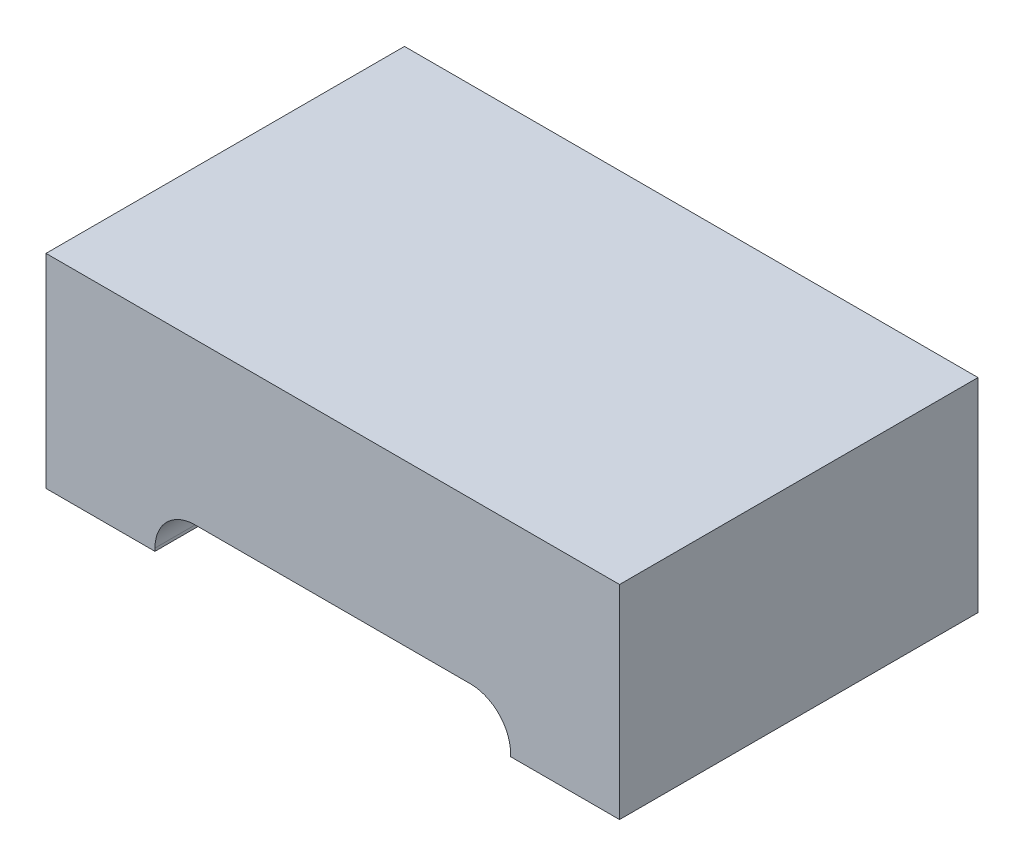
ISO-10303-21;
HEADER;
FILE_DESCRIPTION(('STEP AP214'),'2;1');
FILE_NAME('part.step','',(''),(''),'','','');
FILE_SCHEMA(('AUTOMOTIVE_DESIGN { 1 0 10303 214 1 1 1 1 }'));
ENDSEC;
DATA;
#1=APPLICATION_CONTEXT('core data for automotive mechanical design processes');
#2=APPLICATION_PROTOCOL_DEFINITION('international standard','automotive_design',2000,#1);
#3=PRODUCT_CONTEXT('',#1,'mechanical');
#4=PRODUCT('Part','Part','',(#3));
#5=PRODUCT_RELATED_PRODUCT_CATEGORY('part','',(#4));
#6=PRODUCT_DEFINITION_FORMATION('','',#4);
#7=PRODUCT_DEFINITION_CONTEXT('part definition',#1,'design');
#8=PRODUCT_DEFINITION('design','',#6,#7);
#9=PRODUCT_DEFINITION_SHAPE('','',#8);
#10=(LENGTH_UNIT() NAMED_UNIT(*) SI_UNIT(.MILLI.,.METRE.));
#11=(NAMED_UNIT(*) PLANE_ANGLE_UNIT() SI_UNIT($,.RADIAN.));
#12=(NAMED_UNIT(*) SI_UNIT($,.STERADIAN.) SOLID_ANGLE_UNIT());
#13=UNCERTAINTY_MEASURE_WITH_UNIT(LENGTH_MEASURE(1.E-05),#10,'distance_accuracy_value','');
#14=(GEOMETRIC_REPRESENTATION_CONTEXT(3) GLOBAL_UNCERTAINTY_ASSIGNED_CONTEXT((#13)) GLOBAL_UNIT_ASSIGNED_CONTEXT((#10,
#11,#12)) REPRESENTATION_CONTEXT('',''));
#15=CARTESIAN_POINT('',(0.,0.,0.));
#16=DIRECTION('',(0.,0.,1.));
#17=DIRECTION('',(1.,0.,0.));
#18=AXIS2_PLACEMENT_3D('',#15,#16,#17);
#19=CARTESIAN_POINT('',(0.,0.,0.));
#20=DIRECTION('',(0.,-1.,0.));
#21=DIRECTION('',(0.,0.,-1.));
#22=AXIS2_PLACEMENT_3D('',#19,#20,#21);
#23=PLANE('',#22);
#24=DIRECTION('',(0.,0.,1.));
#25=VECTOR('',#24,1.);
#26=CARTESIAN_POINT('',(-0.62,0.,-0.625));
#27=LINE('',#26,#25);
#28=CARTESIAN_POINT('',(-0.62,0.,-0.625));
#29=VERTEX_POINT('',#28);
#30=CARTESIAN_POINT('',(-0.62,0.,0.625));
#31=VERTEX_POINT('',#30);
#32=EDGE_CURVE('E122',#29,#31,#27,.T.);
#33=ORIENTED_EDGE('',*,*,#32,.T.);
#34=DIRECTION('',(1.,0.,0.));
#35=VECTOR('',#34,1.);
#36=CARTESIAN_POINT('',(-1.,0.,0.625));
#37=LINE('',#36,#35);
#38=CARTESIAN_POINT('',(-1.,0.,0.625));
#39=VERTEX_POINT('',#38);
#40=EDGE_CURVE('E134',#39,#31,#37,.T.);
#41=ORIENTED_EDGE('',*,*,#40,.F.);
#42=DIRECTION('',(0.,0.,1.));
#43=VECTOR('',#42,1.);
#44=CARTESIAN_POINT('',(-1.,0.,0.625));
#45=LINE('',#44,#43);
#46=CARTESIAN_POINT('',(-1.,0.,-0.625));
#47=VERTEX_POINT('',#46);
#48=EDGE_CURVE('E146',#47,#39,#45,.T.);
#49=ORIENTED_EDGE('',*,*,#48,.F.);
#50=DIRECTION('',(-1.,0.,0.));
#51=VECTOR('',#50,1.);
#52=CARTESIAN_POINT('',(-1.,0.,-0.625));
#53=LINE('',#52,#51);
#54=EDGE_CURVE('E135',#29,#47,#53,.T.);
#55=ORIENTED_EDGE('',*,*,#54,.F.);
#56=EDGE_LOOP('',(#33,#41,#49,#55));
#57=FACE_BOUND('',#56,.T.);
#58=ADVANCED_FACE('F33',(#57),#23,.T.);
#59=CARTESIAN_POINT('',(1.,0.71,0.625));
#60=DIRECTION('',(-1.,0.,0.));
#61=DIRECTION('',(0.,0.,1.));
#62=AXIS2_PLACEMENT_3D('',#59,#60,#61);
#63=PLANE('',#62);
#64=DIRECTION('',(0.,0.,-1.));
#65=VECTOR('',#64,1.);
#66=CARTESIAN_POINT('',(1.,0.,0.625));
#67=LINE('',#66,#65);
#68=CARTESIAN_POINT('',(1.,0.,0.625));
#69=VERTEX_POINT('',#68);
#70=CARTESIAN_POINT('',(1.,0.,-0.625));
#71=VERTEX_POINT('',#70);
#72=EDGE_CURVE('E159',#69,#71,#67,.T.);
#73=ORIENTED_EDGE('',*,*,#72,.T.);
#74=DIRECTION('',(0.,-1.,0.));
#75=VECTOR('',#74,1.);
#76=CARTESIAN_POINT('',(1.,0.71,-0.625));
#77=LINE('',#76,#75);
#78=CARTESIAN_POINT('',(1.,0.71,-0.625));
#79=VERTEX_POINT('',#78);
#80=EDGE_CURVE('E11',#79,#71,#77,.T.);
#81=ORIENTED_EDGE('',*,*,#80,.F.);
#82=DIRECTION('',(0.,0.,-1.));
#83=VECTOR('',#82,1.);
#84=CARTESIAN_POINT('',(1.,0.71,0.625));
#85=LINE('',#84,#83);
#86=CARTESIAN_POINT('',(1.,0.71,0.625));
#87=VERTEX_POINT('',#86);
#88=EDGE_CURVE('E143',#87,#79,#85,.T.);
#89=ORIENTED_EDGE('',*,*,#88,.F.);
#90=DIRECTION('',(0.,-1.,0.));
#91=VECTOR('',#90,1.);
#92=CARTESIAN_POINT('',(1.,0.71,0.625));
#93=LINE('',#92,#91);
#94=EDGE_CURVE('E150',#87,#69,#93,.T.);
#95=ORIENTED_EDGE('',*,*,#94,.T.);
#96=EDGE_LOOP('',(#73,#81,#89,#95));
#97=FACE_BOUND('',#96,.T.);
#98=ADVANCED_FACE('F35',(#97),#63,.F.);
#99=CARTESIAN_POINT('',(-1.,0.71,-0.625));
#100=DIRECTION('',(0.,0.,1.));
#101=DIRECTION('',(1.,0.,0.));
#102=AXIS2_PLACEMENT_3D('',#99,#100,#101);
#103=PLANE('',#102);
#104=CARTESIAN_POINT('',(-0.48,0.01,-0.625));
#105=DIRECTION('',(0.,0.,1.));
#106=DIRECTION('',(-1.,0.,0.));
#107=AXIS2_PLACEMENT_3D('',#104,#105,#106);
#108=CIRCLE('',#107,0.14);
#109=CARTESIAN_POINT('',(-0.479999999999999,0.15,-0.625));
#110=VERTEX_POINT('',#109);
#111=CARTESIAN_POINT('',(-0.62,0.009999999999999,-0.625));
#112=VERTEX_POINT('',#111);
#113=EDGE_CURVE('E137',#110,#112,#108,.T.);
#114=ORIENTED_EDGE('',*,*,#113,.T.);
#115=DIRECTION('',(0.,-1.,0.));
#116=VECTOR('',#115,1.);
#117=CARTESIAN_POINT('',(-0.62,0.,-0.625));
#118=LINE('',#117,#116);
#119=EDGE_CURVE('E183',#112,#29,#118,.T.);
#120=ORIENTED_EDGE('',*,*,#119,.T.);
#121=ORIENTED_EDGE('',*,*,#54,.T.);
#122=DIRECTION('',(0.,-1.,0.));
#123=VECTOR('',#122,1.);
#124=CARTESIAN_POINT('',(-1.,0.71,-0.625));
#125=LINE('',#124,#123);
#126=CARTESIAN_POINT('',(-1.,0.71,-0.625));
#127=VERTEX_POINT('',#126);
#128=EDGE_CURVE('E41',#127,#47,#125,.T.);
#129=ORIENTED_EDGE('',*,*,#128,.F.);
#130=DIRECTION('',(-1.,0.,0.));
#131=VECTOR('',#130,1.);
#132=CARTESIAN_POINT('',(-1.,0.71,-0.625));
#133=LINE('',#132,#131);
#134=EDGE_CURVE('E85',#79,#127,#133,.T.);
#135=ORIENTED_EDGE('',*,*,#134,.F.);
#136=ORIENTED_EDGE('',*,*,#80,.T.);
#137=CARTESIAN_POINT('',(0.62,0.,-0.625));
#138=VERTEX_POINT('',#137);
#139=EDGE_CURVE('E157',#71,#138,#53,.T.);
#140=ORIENTED_EDGE('',*,*,#139,.T.);
#141=DIRECTION('',(0.,1.,0.));
#142=VECTOR('',#141,1.);
#143=CARTESIAN_POINT('',(0.62,0.,-0.625));
#144=LINE('',#143,#142);
#145=CARTESIAN_POINT('',(0.62,0.00999999999999916,-0.625));
#146=VERTEX_POINT('',#145);
#147=EDGE_CURVE('E48',#138,#146,#144,.T.);
#148=ORIENTED_EDGE('',*,*,#147,.T.);
#149=CARTESIAN_POINT('',(0.48,0.0100000000000002,-0.625));
#150=DIRECTION('',(0.,0.,1.));
#151=DIRECTION('',(-1.,0.,0.));
#152=AXIS2_PLACEMENT_3D('',#149,#150,#151);
#153=CIRCLE('',#152,0.14);
#154=CARTESIAN_POINT('',(0.479999999999999,0.15,-0.625));
#155=VERTEX_POINT('',#154);
#156=EDGE_CURVE('E179',#146,#155,#153,.T.);
#157=ORIENTED_EDGE('',*,*,#156,.T.);
#158=DIRECTION('',(-1.,0.,0.));
#159=VECTOR('',#158,1.);
#160=CARTESIAN_POINT('',(-0.479999999999999,0.15,-0.625));
#161=LINE('',#160,#159);
#162=EDGE_CURVE('E176',#155,#110,#161,.T.);
#163=ORIENTED_EDGE('',*,*,#162,.T.);
#164=EDGE_LOOP('',(#114,#120,#121,#129,#135,#136,#140,#148,#157,#163));
#165=FACE_BOUND('',#164,.T.);
#166=ADVANCED_FACE('F201',(#165),#103,.F.);
#167=CARTESIAN_POINT('',(-1.,0.71,0.625));
#168=DIRECTION('',(1.,0.,0.));
#169=DIRECTION('',(0.,0.,-1.));
#170=AXIS2_PLACEMENT_3D('',#167,#168,#169);
#171=PLANE('',#170);
#172=ORIENTED_EDGE('',*,*,#48,.T.);
#173=DIRECTION('',(0.,-1.,0.));
#174=VECTOR('',#173,1.);
#175=CARTESIAN_POINT('',(-1.,0.71,0.625));
#176=LINE('',#175,#174);
#177=CARTESIAN_POINT('',(-1.,0.71,0.625));
#178=VERTEX_POINT('',#177);
#179=EDGE_CURVE('E142',#178,#39,#176,.T.);
#180=ORIENTED_EDGE('',*,*,#179,.F.);
#181=DIRECTION('',(0.,0.,1.));
#182=VECTOR('',#181,1.);
#183=CARTESIAN_POINT('',(-1.,0.71,0.625));
#184=LINE('',#183,#182);
#185=EDGE_CURVE('E156',#127,#178,#184,.T.);
#186=ORIENTED_EDGE('',*,*,#185,.F.);
#187=ORIENTED_EDGE('',*,*,#128,.T.);
#188=EDGE_LOOP('',(#172,#180,#186,#187));
#189=FACE_BOUND('',#188,.T.);
#190=ADVANCED_FACE('F155',(#189),#171,.F.);
#191=CARTESIAN_POINT('',(-1.,0.71,0.625));
#192=DIRECTION('',(0.,0.,-1.));
#193=DIRECTION('',(-1.,0.,0.));
#194=AXIS2_PLACEMENT_3D('',#191,#192,#193);
#195=PLANE('',#194);
#196=ORIENTED_EDGE('',*,*,#40,.T.);
#197=DIRECTION('',(0.,-1.,0.));
#198=VECTOR('',#197,1.);
#199=CARTESIAN_POINT('',(-0.62,0.,0.625));
#200=LINE('',#199,#198);
#201=CARTESIAN_POINT('',(-0.62,0.009999999999999,0.625));
#202=VERTEX_POINT('',#201);
#203=EDGE_CURVE('E118',#202,#31,#200,.T.);
#204=ORIENTED_EDGE('',*,*,#203,.F.);
#205=CARTESIAN_POINT('',(-0.48,0.01,0.625));
#206=DIRECTION('',(0.,0.,1.));
#207=DIRECTION('',(-1.,0.,0.));
#208=AXIS2_PLACEMENT_3D('',#205,#206,#207);
#209=CIRCLE('',#208,0.14);
#210=CARTESIAN_POINT('',(-0.479999999999999,0.15,0.625));
#211=VERTEX_POINT('',#210);
#212=EDGE_CURVE('E185',#211,#202,#209,.T.);
#213=ORIENTED_EDGE('',*,*,#212,.F.);
#214=DIRECTION('',(-1.,0.,0.));
#215=VECTOR('',#214,1.);
#216=CARTESIAN_POINT('',(-0.479999999999999,0.15,0.625));
#217=LINE('',#216,#215);
#218=CARTESIAN_POINT('',(0.479999999999999,0.15,0.625));
#219=VERTEX_POINT('',#218);
#220=EDGE_CURVE('E187',#219,#211,#217,.T.);
#221=ORIENTED_EDGE('',*,*,#220,.F.);
#222=CARTESIAN_POINT('',(0.48,0.0100000000000002,0.625));
#223=DIRECTION('',(0.,0.,1.));
#224=DIRECTION('',(-1.,0.,0.));
#225=AXIS2_PLACEMENT_3D('',#222,#223,#224);
#226=CIRCLE('',#225,0.14);
#227=CARTESIAN_POINT('',(0.62,0.00999999999999916,0.625));
#228=VERTEX_POINT('',#227);
#229=EDGE_CURVE('E190',#228,#219,#226,.T.);
#230=ORIENTED_EDGE('',*,*,#229,.F.);
#231=DIRECTION('',(0.,1.,0.));
#232=VECTOR('',#231,1.);
#233=CARTESIAN_POINT('',(0.62,0.,0.625));
#234=LINE('',#233,#232);
#235=CARTESIAN_POINT('',(0.62,0.,0.625));
#236=VERTEX_POINT('',#235);
#237=EDGE_CURVE('E128',#236,#228,#234,.T.);
#238=ORIENTED_EDGE('',*,*,#237,.F.);
#239=EDGE_CURVE('E78',#236,#69,#37,.T.);
#240=ORIENTED_EDGE('',*,*,#239,.T.);
#241=ORIENTED_EDGE('',*,*,#94,.F.);
#242=DIRECTION('',(1.,0.,0.));
#243=VECTOR('',#242,1.);
#244=CARTESIAN_POINT('',(-1.,0.71,0.625));
#245=LINE('',#244,#243);
#246=EDGE_CURVE('E57',#178,#87,#245,.T.);
#247=ORIENTED_EDGE('',*,*,#246,.F.);
#248=ORIENTED_EDGE('',*,*,#179,.T.);
#249=EDGE_LOOP('',(#196,#204,#213,#221,#230,#238,#240,#241,#247,#248));
#250=FACE_BOUND('',#249,.T.);
#251=ADVANCED_FACE('F140',(#250),#195,.F.);
#252=CARTESIAN_POINT('',(0.,0.71,0.));
#253=DIRECTION('',(0.,-1.,0.));
#254=DIRECTION('',(0.,0.,-1.));
#255=AXIS2_PLACEMENT_3D('',#252,#253,#254);
#256=PLANE('',#255);
#257=ORIENTED_EDGE('',*,*,#88,.T.);
#258=ORIENTED_EDGE('',*,*,#134,.T.);
#259=ORIENTED_EDGE('',*,*,#185,.T.);
#260=ORIENTED_EDGE('',*,*,#246,.T.);
#261=EDGE_LOOP('',(#257,#258,#259,#260));
#262=FACE_BOUND('',#261,.T.);
#263=ADVANCED_FACE('F218',(#262),#256,.F.);
#264=DIRECTION('',(0.,0.,1.));
#265=VECTOR('',#264,1.);
#266=CARTESIAN_POINT('',(0.62,0.,-0.625));
#267=LINE('',#266,#265);
#268=EDGE_CURVE('E136',#138,#236,#267,.T.);
#269=ORIENTED_EDGE('',*,*,#268,.F.);
#270=ORIENTED_EDGE('',*,*,#139,.F.);
#271=ORIENTED_EDGE('',*,*,#72,.F.);
#272=ORIENTED_EDGE('',*,*,#239,.F.);
#273=EDGE_LOOP('',(#269,#270,#271,#272));
#274=FACE_BOUND('',#273,.T.);
#275=ADVANCED_FACE('F212',(#274),#23,.T.);
#276=CARTESIAN_POINT('',(-0.62,0.,-0.625));
#277=DIRECTION('',(-1.,0.,0.));
#278=DIRECTION('',(0.,0.,1.));
#279=AXIS2_PLACEMENT_3D('',#276,#277,#278);
#280=PLANE('',#279);
#281=ORIENTED_EDGE('',*,*,#32,.F.);
#282=ORIENTED_EDGE('',*,*,#119,.F.);
#283=DIRECTION('',(0.,0.,1.));
#284=VECTOR('',#283,1.);
#285=CARTESIAN_POINT('',(-0.62,0.009999999999999,-0.625));
#286=LINE('',#285,#284);
#287=EDGE_CURVE('E124',#112,#202,#286,.T.);
#288=ORIENTED_EDGE('',*,*,#287,.T.);
#289=ORIENTED_EDGE('',*,*,#203,.T.);
#290=EDGE_LOOP('',(#281,#282,#288,#289));
#291=FACE_BOUND('',#290,.T.);
#292=ADVANCED_FACE('F120',(#291),#280,.F.);
#293=CARTESIAN_POINT('',(-0.48,0.01,-0.625));
#294=DIRECTION('',(0.,0.,1.));
#295=DIRECTION('',(1.,0.,0.));
#296=AXIS2_PLACEMENT_3D('',#293,#294,#295);
#297=CYLINDRICAL_SURFACE('',#296,0.14);
#298=ORIENTED_EDGE('',*,*,#287,.F.);
#299=ORIENTED_EDGE('',*,*,#113,.F.);
#300=DIRECTION('',(0.,0.,1.));
#301=VECTOR('',#300,1.);
#302=CARTESIAN_POINT('',(-0.479999999999999,0.15,-0.625));
#303=LINE('',#302,#301);
#304=EDGE_CURVE('E171',#110,#211,#303,.T.);
#305=ORIENTED_EDGE('',*,*,#304,.T.);
#306=ORIENTED_EDGE('',*,*,#212,.T.);
#307=EDGE_LOOP('',(#298,#299,#305,#306));
#308=FACE_BOUND('',#307,.T.);
#309=ADVANCED_FACE('F224',(#308),#297,.F.);
#310=CARTESIAN_POINT('',(-0.479999999999999,0.15,-0.625));
#311=DIRECTION('',(0.,1.,0.));
#312=DIRECTION('',(-1.,0.,0.));
#313=AXIS2_PLACEMENT_3D('',#310,#311,#312);
#314=PLANE('',#313);
#315=ORIENTED_EDGE('',*,*,#304,.F.);
#316=ORIENTED_EDGE('',*,*,#162,.F.);
#317=DIRECTION('',(0.,0.,1.));
#318=VECTOR('',#317,1.);
#319=CARTESIAN_POINT('',(0.479999999999999,0.15,-0.625));
#320=LINE('',#319,#318);
#321=EDGE_CURVE('E169',#155,#219,#320,.T.);
#322=ORIENTED_EDGE('',*,*,#321,.T.);
#323=ORIENTED_EDGE('',*,*,#220,.T.);
#324=EDGE_LOOP('',(#315,#316,#322,#323));
#325=FACE_BOUND('',#324,.T.);
#326=ADVANCED_FACE('F237',(#325),#314,.F.);
#327=CARTESIAN_POINT('',(0.48,0.0100000000000002,-0.625));
#328=DIRECTION('',(0.,0.,1.));
#329=DIRECTION('',(1.,0.,0.));
#330=AXIS2_PLACEMENT_3D('',#327,#328,#329);
#331=CYLINDRICAL_SURFACE('',#330,0.14);
#332=ORIENTED_EDGE('',*,*,#321,.F.);
#333=ORIENTED_EDGE('',*,*,#156,.F.);
#334=DIRECTION('',(0.,0.,1.));
#335=VECTOR('',#334,1.);
#336=CARTESIAN_POINT('',(0.62,0.00999999999999916,-0.625));
#337=LINE('',#336,#335);
#338=EDGE_CURVE('E167',#146,#228,#337,.T.);
#339=ORIENTED_EDGE('',*,*,#338,.T.);
#340=ORIENTED_EDGE('',*,*,#229,.T.);
#341=EDGE_LOOP('',(#332,#333,#339,#340));
#342=FACE_BOUND('',#341,.T.);
#343=ADVANCED_FACE('F199',(#342),#331,.F.);
#344=CARTESIAN_POINT('',(0.62,0.,-0.625));
#345=DIRECTION('',(1.,0.,0.));
#346=DIRECTION('',(0.,0.,-1.));
#347=AXIS2_PLACEMENT_3D('',#344,#345,#346);
#348=PLANE('',#347);
#349=ORIENTED_EDGE('',*,*,#338,.F.);
#350=ORIENTED_EDGE('',*,*,#147,.F.);
#351=ORIENTED_EDGE('',*,*,#268,.T.);
#352=ORIENTED_EDGE('',*,*,#237,.T.);
#353=EDGE_LOOP('',(#349,#350,#351,#352));
#354=FACE_BOUND('',#353,.T.);
#355=ADVANCED_FACE('F195',(#354),#348,.F.);
#356=CLOSED_SHELL('',(#58,#98,#166,#190,#251,#263,#275,#292,#309,#326,#343,#355));
#357=MANIFOLD_SOLID_BREP('B2',#356);
#358=ADVANCED_BREP_SHAPE_REPRESENTATION('',(#18,#357),#14);
#359=SHAPE_DEFINITION_REPRESENTATION(#9,#358);
ENDSEC;
END-ISO-10303-21;
